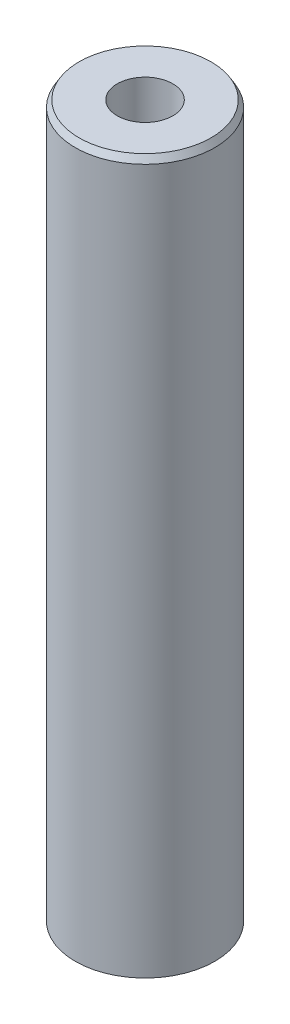
ISO-10303-21;
HEADER;
FILE_DESCRIPTION(('STEP AP214'),'2;1');
FILE_NAME('part.step','',(''),(''),'','','');
FILE_SCHEMA(('AUTOMOTIVE_DESIGN { 1 0 10303 214 1 1 1 1 }'));
ENDSEC;
DATA;
#1=APPLICATION_CONTEXT('core data for automotive mechanical design processes');
#2=APPLICATION_PROTOCOL_DEFINITION('international standard','automotive_design',2000,#1);
#3=PRODUCT_CONTEXT('',#1,'mechanical');
#4=PRODUCT('Part','Part','',(#3));
#5=PRODUCT_RELATED_PRODUCT_CATEGORY('part','',(#4));
#6=PRODUCT_DEFINITION_FORMATION('','',#4);
#7=PRODUCT_DEFINITION_CONTEXT('part definition',#1,'design');
#8=PRODUCT_DEFINITION('design','',#6,#7);
#9=PRODUCT_DEFINITION_SHAPE('','',#8);
#10=(LENGTH_UNIT() NAMED_UNIT(*) SI_UNIT(.MILLI.,.METRE.));
#11=(NAMED_UNIT(*) PLANE_ANGLE_UNIT() SI_UNIT($,.RADIAN.));
#12=(NAMED_UNIT(*) SI_UNIT($,.STERADIAN.) SOLID_ANGLE_UNIT());
#13=UNCERTAINTY_MEASURE_WITH_UNIT(LENGTH_MEASURE(1.E-05),#10,'distance_accuracy_value','');
#14=(GEOMETRIC_REPRESENTATION_CONTEXT(3) GLOBAL_UNCERTAINTY_ASSIGNED_CONTEXT((#13)) GLOBAL_UNIT_ASSIGNED_CONTEXT((#10,
#11,#12)) REPRESENTATION_CONTEXT('',''));
#15=CARTESIAN_POINT('',(0.,0.,0.));
#16=DIRECTION('',(0.,0.,1.));
#17=DIRECTION('',(1.,0.,0.));
#18=AXIS2_PLACEMENT_3D('',#15,#16,#17);
#19=CARTESIAN_POINT('',(0.,358.756242064217,0.));
#20=DIRECTION('',(0.,-1.,0.));
#21=DIRECTION('',(0.,0.,-1.));
#22=AXIS2_PLACEMENT_3D('',#19,#20,#21);
#23=CYLINDRICAL_SURFACE('',#22,35.);
#24=CARTESIAN_POINT('',(0.,355.456196695833,0.));
#25=DIRECTION('',(0.,1.,0.));
#26=DIRECTION('',(0.,0.,1.));
#27=AXIS2_PLACEMENT_3D('',#24,#25,#26);
#28=CIRCLE('',#27,35.);
#29=CARTESIAN_POINT('',(0.,355.456196695833,-35.));
#30=VERTEX_POINT('',#29);
#31=EDGE_CURVE('E50',#30,#30,#28,.F.);
#32=ORIENTED_EDGE('',*,*,#31,.T.);
#33=EDGE_LOOP('',(#32));
#34=FACE_BOUND('',#33,.T.);
#35=CARTESIAN_POINT('',(0.,1.90528208177398,0.));
#36=DIRECTION('',(0.,1.,0.));
#37=DIRECTION('',(0.,0.,1.));
#38=AXIS2_PLACEMENT_3D('',#35,#36,#37);
#39=CIRCLE('',#38,35.);
#40=CARTESIAN_POINT('',(0.,1.90528208177398,35.));
#41=VERTEX_POINT('',#40);
#42=EDGE_CURVE('E51',#41,#41,#39,.T.);
#43=ORIENTED_EDGE('',*,*,#42,.T.);
#44=EDGE_LOOP('',(#43));
#45=FACE_BOUND('',#44,.T.);
#46=ADVANCED_FACE('F39',(#34,#45),#23,.T.);
#47=CARTESIAN_POINT('',(0.,358.756242064217,0.));
#48=DIRECTION('',(0.,1.,0.));
#49=DIRECTION('',(0.,0.,1.));
#50=AXIS2_PLACEMENT_3D('',#47,#48,#49);
#51=PLANE('',#50);
#52=CARTESIAN_POINT('',(0.,358.756242064217,0.));
#53=DIRECTION('',(0.,1.,0.));
#54=DIRECTION('',(0.,0.,1.));
#55=AXIS2_PLACEMENT_3D('',#52,#53,#54);
#56=CIRCLE('',#55,33.094717918226);
#57=CARTESIAN_POINT('',(0.,358.756242064217,-33.0947179182261));
#58=VERTEX_POINT('',#57);
#59=EDGE_CURVE('E54',#58,#58,#56,.T.);
#60=ORIENTED_EDGE('',*,*,#59,.T.);
#61=EDGE_LOOP('',(#60));
#62=FACE_BOUND('',#61,.T.);
#63=CARTESIAN_POINT('',(0.,358.756242064217,0.));
#64=DIRECTION('',(0.,1.,0.));
#65=DIRECTION('',(0.,0.,1.));
#66=AXIS2_PLACEMENT_3D('',#63,#64,#65);
#67=CIRCLE('',#66,13.9432514472612);
#68=CARTESIAN_POINT('',(0.,358.756242064217,13.9432514472612));
#69=VERTEX_POINT('',#68);
#70=EDGE_CURVE('E58',#69,#69,#67,.T.);
#71=ORIENTED_EDGE('',*,*,#70,.F.);
#72=EDGE_LOOP('',(#71));
#73=FACE_BOUND('',#72,.T.);
#74=ADVANCED_FACE('F69',(#62,#73),#51,.T.);
#75=CARTESIAN_POINT('',(0.,0.,0.));
#76=DIRECTION('',(0.,1.,0.));
#77=DIRECTION('',(0.,0.,1.));
#78=AXIS2_PLACEMENT_3D('',#75,#76,#77);
#79=PLANE('',#78);
#80=CARTESIAN_POINT('',(0.,0.,0.));
#81=DIRECTION('',(0.,1.,0.));
#82=DIRECTION('',(0.,0.,1.));
#83=AXIS2_PLACEMENT_3D('',#80,#81,#82);
#84=CIRCLE('',#83,31.6999546316168);
#85=CARTESIAN_POINT('',(0.,0.,31.6999546316168));
#86=VERTEX_POINT('',#85);
#87=EDGE_CURVE('E10',#86,#86,#84,.F.);
#88=ORIENTED_EDGE('',*,*,#87,.T.);
#89=EDGE_LOOP('',(#88));
#90=FACE_BOUND('',#89,.T.);
#91=CARTESIAN_POINT('',(0.,0.,0.));
#92=DIRECTION('',(0.,1.,0.));
#93=DIRECTION('',(0.,0.,1.));
#94=AXIS2_PLACEMENT_3D('',#91,#92,#93);
#95=CIRCLE('',#94,13.9432514472612);
#96=CARTESIAN_POINT('',(0.,0.,13.9432514472612));
#97=VERTEX_POINT('',#96);
#98=EDGE_CURVE('E63',#97,#97,#95,.T.);
#99=ORIENTED_EDGE('',*,*,#98,.T.);
#100=EDGE_LOOP('',(#99));
#101=FACE_BOUND('',#100,.T.);
#102=ADVANCED_FACE('F75',(#90,#101),#79,.F.);
#103=CARTESIAN_POINT('',(0.,358.756242064217,0.));
#104=DIRECTION('',(0.,-1.,0.));
#105=DIRECTION('',(0.,0.,-1.));
#106=AXIS2_PLACEMENT_3D('',#103,#104,#105);
#107=CYLINDRICAL_SURFACE('',#106,13.9432514472612);
#108=ORIENTED_EDGE('',*,*,#70,.T.);
#109=EDGE_LOOP('',(#108));
#110=FACE_BOUND('',#109,.T.);
#111=ORIENTED_EDGE('',*,*,#98,.F.);
#112=EDGE_LOOP('',(#111));
#113=FACE_BOUND('',#112,.T.);
#114=ADVANCED_FACE('F70',(#110,#113),#107,.F.);
#115=CARTESIAN_POINT('',(0.,358.756242064217,0.));
#116=DIRECTION('',(0.,-1.,0.));
#117=DIRECTION('',(0.,0.,-1.));
#118=AXIS2_PLACEMENT_3D('',#115,#116,#117);
#119=CONICAL_SURFACE('',#118,33.094717918226,0.523598775598288);
#120=CARTESIAN_POINT('',(0.,355.456196695833,-35.));
#121=CARTESIAN_POINT('',(0.,355.490572168421,-34.9801533116482));
#122=CARTESIAN_POINT('',(0.,355.524947641008,-34.9603066232964));
#123=CARTESIAN_POINT('',(0.,355.593698586183,-34.9206132465928));
#124=CARTESIAN_POINT('',(0.,355.62807405877,-34.900766558241));
#125=CARTESIAN_POINT('',(0.,355.696825003945,-34.8610731815373));
#126=CARTESIAN_POINT('',(0.,355.731200476532,-34.8412264931855));
#127=CARTESIAN_POINT('',(0.,355.799951421707,-34.8015331164819));
#128=CARTESIAN_POINT('',(0.,355.834326894294,-34.7816864281301));
#129=CARTESIAN_POINT('',(0.,355.903077839469,-34.7419930514265));
#130=CARTESIAN_POINT('',(0.,355.937453312056,-34.7221463630747));
#131=CARTESIAN_POINT('',(0.,356.006204257231,-34.682452986371));
#132=CARTESIAN_POINT('',(0.,356.040579729818,-34.6626062980192));
#133=CARTESIAN_POINT('',(0.,356.109330674993,-34.6229129213156));
#134=CARTESIAN_POINT('',(0.,356.14370614758,-34.6030662329638));
#135=CARTESIAN_POINT('',(0.,356.212457092755,-34.5633728562602));
#136=CARTESIAN_POINT('',(0.,356.246832565342,-34.5435261679084));
#137=CARTESIAN_POINT('',(0.,356.315583510516,-34.5038327912047));
#138=CARTESIAN_POINT('',(0.,356.349958983104,-34.4839861028529));
#139=CARTESIAN_POINT('',(0.,356.418709928278,-34.4442927261493));
#140=CARTESIAN_POINT('',(0.,356.453085400866,-34.4244460377975));
#141=CARTESIAN_POINT('',(0.,356.52183634604,-34.3847526610938));
#142=CARTESIAN_POINT('',(0.,356.556211818628,-34.364905972742));
#143=CARTESIAN_POINT('',(0.,356.624962763802,-34.3252125960384));
#144=CARTESIAN_POINT('',(0.,356.65933823639,-34.3053659076866));
#145=CARTESIAN_POINT('',(0.,356.728089181564,-34.265672530983));
#146=CARTESIAN_POINT('',(0.,356.762464654152,-34.2458258426312));
#147=CARTESIAN_POINT('',(0.,356.831215599326,-34.2061324659275));
#148=CARTESIAN_POINT('',(0.,356.865591071914,-34.1862857775757));
#149=CARTESIAN_POINT('',(0.,356.934342017088,-34.1465924008721));
#150=CARTESIAN_POINT('',(0.,356.968717489676,-34.1267457125203));
#151=CARTESIAN_POINT('',(0.,357.03746843485,-34.0870523358167));
#152=CARTESIAN_POINT('',(0.,357.071843907438,-34.0672056474649));
#153=CARTESIAN_POINT('',(0.,357.140594852612,-34.0275122707612));
#154=CARTESIAN_POINT('',(0.,357.1749703252,-34.0076655824094));
#155=CARTESIAN_POINT('',(0.,357.243721270374,-33.9679722057058));
#156=CARTESIAN_POINT('',(0.,357.278096742962,-33.948125517354));
#157=CARTESIAN_POINT('',(0.,357.346847688136,-33.9084321406504));
#158=CARTESIAN_POINT('',(0.,357.381223160724,-33.8885854522985));
#159=CARTESIAN_POINT('',(0.,357.449974105898,-33.8488920755949));
#160=CARTESIAN_POINT('',(0.,357.484349578486,-33.8290453872431));
#161=CARTESIAN_POINT('',(0.,357.55310052366,-33.7893520105395));
#162=CARTESIAN_POINT('',(0.,357.587475996248,-33.7695053221877));
#163=CARTESIAN_POINT('',(0.,357.656226941422,-33.7298119454841));
#164=CARTESIAN_POINT('',(0.,357.690602414009,-33.7099652571322));
#165=CARTESIAN_POINT('',(0.,357.759353359184,-33.6702718804286));
#166=CARTESIAN_POINT('',(0.,357.793728831771,-33.6504251920768));
#167=CARTESIAN_POINT('',(0.,357.862479776946,-33.6107318153732));
#168=CARTESIAN_POINT('',(0.,357.896855249533,-33.5908851270214));
#169=CARTESIAN_POINT('',(0.,357.965606194708,-33.5511917503177));
#170=CARTESIAN_POINT('',(0.,357.999981667295,-33.5313450619659));
#171=CARTESIAN_POINT('',(0.,358.06873261247,-33.4916516852623));
#172=CARTESIAN_POINT('',(0.,358.103108085057,-33.4718049969105));
#173=CARTESIAN_POINT('',(0.,358.171859030232,-33.4321116202069));
#174=CARTESIAN_POINT('',(0.,358.206234502819,-33.4122649318551));
#175=CARTESIAN_POINT('',(0.,358.274985447994,-33.3725715551514));
#176=CARTESIAN_POINT('',(0.,358.309360920581,-33.3527248667996));
#177=CARTESIAN_POINT('',(0.,358.378111865756,-33.313031490096));
#178=CARTESIAN_POINT('',(0.,358.412487338343,-33.2931848017442));
#179=CARTESIAN_POINT('',(0.,358.481238283518,-33.2534914250406));
#180=CARTESIAN_POINT('',(0.,358.515613756105,-33.2336447366887));
#181=CARTESIAN_POINT('',(0.,358.58436470128,-33.1939513599851));
#182=CARTESIAN_POINT('',(0.,358.618740173867,-33.1741046716333));
#183=CARTESIAN_POINT('',(0.,358.687491119042,-33.1344112949297));
#184=CARTESIAN_POINT('',(0.,358.721866591629,-33.1145646065779));
#185=CARTESIAN_POINT('',(0.,358.756242064217,-33.0947179182261));
#186=B_SPLINE_CURVE_WITH_KNOTS('',3,(#120,#121,#122,#123,#124,#125,#126,#127,#128,#129,#130,
#131,#132,#133,#134,#135,#136,#137,#138,#139,#140,#141,#142,#143,#144,#145,#146,#147,#148,#149,
#150,#151,#152,#153,#154,#155,#156,#157,#158,#159,#160,#161,#162,#163,#164,#165,#166,#167,#168,
#169,#170,#171,#172,#173,#174,#175,#176,#177,#178,#179,#180,#181,#182,#183,#184,#185),
.UNSPECIFIED.,.F.,.F.,(4,2,2,2,2,2,2,2,2,2,2,2,2,2,2,2,2,2,2,2,2,2,2,2,2,2,2,2,2,2,2,2,4),(0.,
0.119080130110898,0.238160260221792,0.357240390332642,0.47632052044354,0.595400650554389,
0.714480780665287,0.833560910776137,0.952641040887035,1.07172117099788,1.19080130110878,
1.30988143121963,1.42896156133053,1.54804169144138,1.66712182155227,1.78620195166312,
1.90528208177402,2.02436221188492,2.14344234199577,2.26252247210667,2.38160260221752,
2.50068273232841,2.61976286243926,2.73884299255016,2.85792312266101,2.97700325277191,
3.09608338288276,3.21516351299365,3.3342436431045,3.4533237732154,3.57240390332625,
3.69148403343715,3.81056416354805),.UNSPECIFIED.);
#187=EDGE_CURVE('BSEAM81',#30,#58,#186,.T.);
#188=ORIENTED_EDGE('',*,*,#31,.F.);
#189=ORIENTED_EDGE('',*,*,#59,.F.);
#190=ORIENTED_EDGE('',*,*,#187,.T.);
#191=ORIENTED_EDGE('',*,*,#187,.F.);
#192=EDGE_LOOP('',(#188,#190,#189,#191));
#193=FACE_BOUND('',#192,.T.);
#194=ADVANCED_FACE('F81',(#193),#119,.T.);
#195=CARTESIAN_POINT('',(0.,1.90528208177398,0.));
#196=DIRECTION('',(0.,1.,0.));
#197=DIRECTION('',(0.,0.,1.));
#198=AXIS2_PLACEMENT_3D('',#195,#196,#197);
#199=CONICAL_SURFACE('',#198,35.,1.0471975511966);
#200=ORIENTED_EDGE('',*,*,#87,.F.);
#201=EDGE_LOOP('',(#200));
#202=FACE_BOUND('',#201,.T.);
#203=ORIENTED_EDGE('',*,*,#42,.F.);
#204=EDGE_LOOP('',(#203));
#205=FACE_BOUND('',#204,.T.);
#206=ADVANCED_FACE('F45',(#202,#205),#199,.T.);
#207=CLOSED_SHELL('',(#46,#74,#102,#114,#194,#206));
#208=MANIFOLD_SOLID_BREP('B2',#207);
#209=ADVANCED_BREP_SHAPE_REPRESENTATION('',(#18,#208),#14);
#210=SHAPE_DEFINITION_REPRESENTATION(#9,#209);
ENDSEC;
END-ISO-10303-21;
